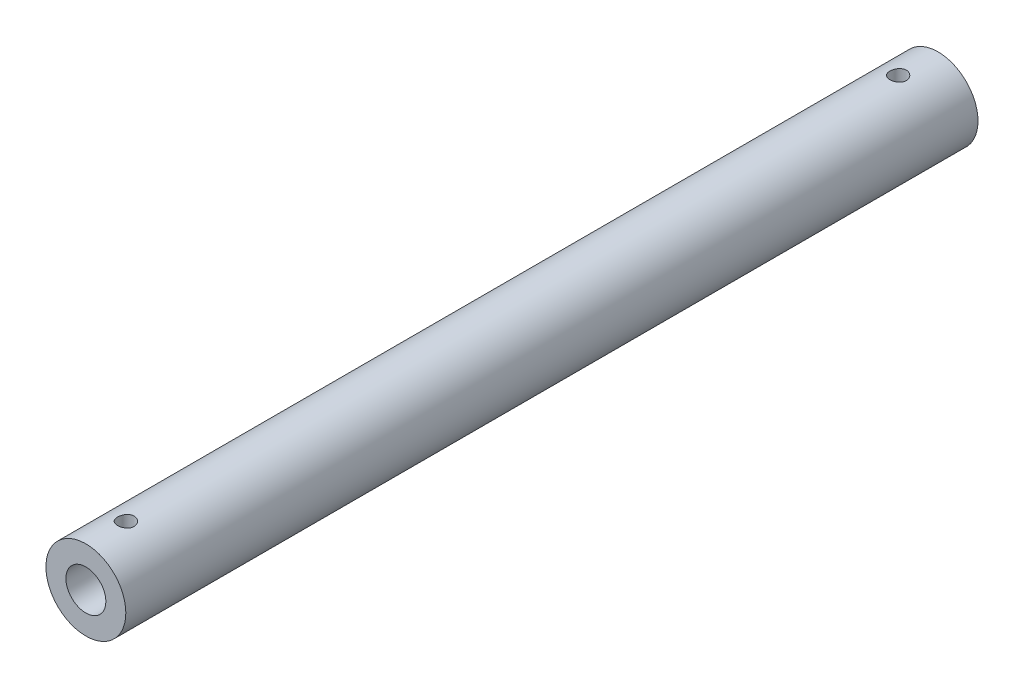
ISO-10303-21;
HEADER;
FILE_DESCRIPTION(('STEP AP214'),'2;1');
FILE_NAME('part.step','',(''),(''),'','','');
FILE_SCHEMA(('AUTOMOTIVE_DESIGN { 1 0 10303 214 1 1 1 1 }'));
ENDSEC;
DATA;
#1=APPLICATION_CONTEXT('core data for automotive mechanical design processes');
#2=APPLICATION_PROTOCOL_DEFINITION('international standard','automotive_design',2000,#1);
#3=PRODUCT_CONTEXT('',#1,'mechanical');
#4=PRODUCT('Part','Part','',(#3));
#5=PRODUCT_RELATED_PRODUCT_CATEGORY('part','',(#4));
#6=PRODUCT_DEFINITION_FORMATION('','',#4);
#7=PRODUCT_DEFINITION_CONTEXT('part definition',#1,'design');
#8=PRODUCT_DEFINITION('design','',#6,#7);
#9=PRODUCT_DEFINITION_SHAPE('','',#8);
#10=(LENGTH_UNIT() NAMED_UNIT(*) SI_UNIT(.MILLI.,.METRE.));
#11=(NAMED_UNIT(*) PLANE_ANGLE_UNIT() SI_UNIT($,.RADIAN.));
#12=(NAMED_UNIT(*) SI_UNIT($,.STERADIAN.) SOLID_ANGLE_UNIT());
#13=UNCERTAINTY_MEASURE_WITH_UNIT(LENGTH_MEASURE(1.E-05),#10,'distance_accuracy_value','');
#14=(GEOMETRIC_REPRESENTATION_CONTEXT(3) GLOBAL_UNCERTAINTY_ASSIGNED_CONTEXT((#13)) GLOBAL_UNIT_ASSIGNED_CONTEXT((#10,
#11,#12)) REPRESENTATION_CONTEXT('',''));
#15=CARTESIAN_POINT('',(0.,0.,0.));
#16=DIRECTION('',(0.,0.,1.));
#17=DIRECTION('',(1.,0.,0.));
#18=AXIS2_PLACEMENT_3D('',#15,#16,#17);
#19=CARTESIAN_POINT('',(0.,0.,-160.));
#20=DIRECTION('',(0.,0.,1.));
#21=DIRECTION('',(1.,0.,0.));
#22=AXIS2_PLACEMENT_3D('',#19,#20,#21);
#23=CYLINDRICAL_SURFACE('',#22,15.);
#24=CARTESIAN_POINT('',(0.,15.,-148.1));
#25=CARTESIAN_POINT('',(-0.172165692568075,14.9999968145247,-148.09999381543));
#26=CARTESIAN_POINT('',(-0.344408344623984,14.997005579049,-148.085609118986));
#27=CARTESIAN_POINT('',(-0.684016768751701,14.9853616038391,-148.028500942385));
#28=CARTESIAN_POINT('',(-0.851378698493533,14.9767045230125,-147.985755732451));
#29=CARTESIAN_POINT('',(-1.17626714760312,14.9546945810427,-147.873310094182));
#30=CARTESIAN_POINT('',(-1.33380320695701,14.9413463608244,-147.803636299415));
#31=CARTESIAN_POINT('',(-1.63494054093473,14.9114015957254,-147.639392320627));
#32=CARTESIAN_POINT('',(-1.77854248092075,14.8948052060611,-147.544823326167));
#33=CARTESIAN_POINT('',(-2.0498140026125,14.8599203077403,-147.332029294186));
#34=CARTESIAN_POINT('',(-2.17725387792712,14.841612714398,-147.21351452613));
#35=CARTESIAN_POINT('',(-2.41059374938866,14.8055061029318,-146.956815694495));
#36=CARTESIAN_POINT('',(-2.51649198363873,14.7877071265103,-146.818630023598));
#37=CARTESIAN_POINT('',(-2.70473262746812,14.7544460628154,-146.524843667008));
#38=CARTESIAN_POINT('',(-2.78683486689837,14.7390084976833,-146.369086071954));
#39=CARTESIAN_POINT('',(-2.92361365563604,14.7124902368737,-146.045614255889));
#40=CARTESIAN_POINT('',(-2.97829310959917,14.7014090797868,-145.877901303354));
#41=CARTESIAN_POINT('',(-3.05792378241659,14.6850518417562,-145.537758146124));
#42=CARTESIAN_POINT('',(-3.08327931876007,14.6796968878264,-145.365426467552));
#43=CARTESIAN_POINT('',(-3.1047987188951,14.6751611480918,-145.018878361106));
#44=CARTESIAN_POINT('',(-3.10096577486347,14.6759796871273,-144.844662141413));
#45=CARTESIAN_POINT('',(-3.06454338331475,14.6836268744082,-144.502264766051));
#46=CARTESIAN_POINT('',(-3.03241955530402,14.6903582036209,-144.334031580759));
#47=CARTESIAN_POINT('',(-2.941063176862,14.7089190681247,-144.005395009546));
#48=CARTESIAN_POINT('',(-2.88182925294599,14.7207488617187,-143.844992020783));
#49=CARTESIAN_POINT('',(-2.73749545783407,14.7482719850807,-143.535238650951));
#50=CARTESIAN_POINT('',(-2.65221295005861,14.7639924411575,-143.385975882204));
#51=CARTESIAN_POINT('',(-2.45833155039526,14.7975084496401,-143.103705768882));
#52=CARTESIAN_POINT('',(-2.34972980522964,14.8153042558583,-142.970700416647));
#53=CARTESIAN_POINT('',(-2.10980951412048,14.8513860400371,-142.722035981014));
#54=CARTESIAN_POINT('',(-1.97809406671113,14.8696748609556,-142.606759914395));
#55=CARTESIAN_POINT('',(-1.69699917981562,14.9043690302707,-142.399875525577));
#56=CARTESIAN_POINT('',(-1.54761948341343,14.920774351266,-142.30826754768));
#57=CARTESIAN_POINT('',(-1.23499644988397,14.949897695655,-142.151240719438));
#58=CARTESIAN_POINT('',(-1.0717293661543,14.9626092321176,-142.085867866775));
#59=CARTESIAN_POINT('',(-0.736208050305239,14.9828639201261,-141.983587276251));
#60=CARTESIAN_POINT('',(-0.563954985205535,14.9904077410196,-141.94667585185));
#61=CARTESIAN_POINT('',(-0.218640650723564,14.9993830838028,-141.902913286729));
#62=CARTESIAN_POINT('',(-0.0456484522188019,15.0009211054796,-141.895538320091));
#63=CARTESIAN_POINT('',(0.299096179156921,14.9980082795858,-141.909644148286));
#64=CARTESIAN_POINT('',(0.47084868604656,14.9935577925971,-141.931123205753));
#65=CARTESIAN_POINT('',(0.806532778422362,14.9792348501822,-142.001892432191));
#66=CARTESIAN_POINT('',(0.970523916752338,14.9694152228943,-142.050911753812));
#67=CARTESIAN_POINT('',(1.28795822388415,14.9454516233604,-142.175072449413));
#68=CARTESIAN_POINT('',(1.44140056223108,14.9313073111298,-142.250215877199));
#69=CARTESIAN_POINT('',(1.73557589191957,14.899998810058,-142.425610431486));
#70=CARTESIAN_POINT('',(1.87611842957523,14.8827978643853,-142.526174288314));
#71=CARTESIAN_POINT('',(2.13852141882691,14.8473663952166,-142.749138749663));
#72=CARTESIAN_POINT('',(2.26037971863336,14.8291357534649,-142.871541865818));
#73=CARTESIAN_POINT('',(2.48399401838078,14.7933375094228,-143.137101775973));
#74=CARTESIAN_POINT('',(2.58538928856013,14.7757855941988,-143.280564810953));
#75=CARTESIAN_POINT('',(2.76264557446454,14.7436744809272,-143.582793178194));
#76=CARTESIAN_POINT('',(2.83850764553234,14.729115159199,-143.741557877655));
#77=CARTESIAN_POINT('',(2.96206237859333,14.704766460738,-144.069061308399));
#78=CARTESIAN_POINT('',(3.00990595506134,14.6949515802098,-144.237741117651));
#79=CARTESIAN_POINT('',(3.07651834817521,14.681151621117,-144.580971786161));
#80=CARTESIAN_POINT('',(3.09529124863373,14.6771657237085,-144.755521817258));
#81=CARTESIAN_POINT('',(3.10307030783305,14.6755226409731,-145.101911198647));
#82=CARTESIAN_POINT('',(3.0926471129851,14.6777441283759,-145.273737409335));
#83=CARTESIAN_POINT('',(3.04359493211144,14.6879932817592,-145.613129865978));
#84=CARTESIAN_POINT('',(3.00496620761724,14.6960208939033,-145.780696151417));
#85=CARTESIAN_POINT('',(2.90086151532538,14.716921819634,-146.106417808972));
#86=CARTESIAN_POINT('',(2.83546006555444,14.7297816752769,-146.264597918068));
#87=CARTESIAN_POINT('',(2.67973384395483,14.7589049039727,-146.567827922407));
#88=CARTESIAN_POINT('',(2.58940680339969,14.7751685868093,-146.712876620833));
#89=CARTESIAN_POINT('',(2.38446392361929,14.809635154064,-146.988558165098));
#90=CARTESIAN_POINT('',(2.26943782754736,14.8278678241242,-147.118882357203));
#91=CARTESIAN_POINT('',(2.01920377162768,14.8640090653401,-147.35856705457));
#92=CARTESIAN_POINT('',(1.88399117387354,14.8819175609528,-147.46792272903));
#93=CARTESIAN_POINT('',(1.59538198786285,14.9156320795551,-147.663740386232));
#94=CARTESIAN_POINT('',(1.44179699181802,14.931412025711,-147.749929381312));
#95=CARTESIAN_POINT('',(1.1220352287178,14.9588332815734,-147.895136111828));
#96=CARTESIAN_POINT('',(0.955869690892333,14.9704782304995,-147.954177753271));
#97=CARTESIAN_POINT('',(0.657833295489258,14.9861185683186,-148.03229271379));
#98=CARTESIAN_POINT('',(0.527631279793755,14.9912930325766,-148.057636596675));
#99=CARTESIAN_POINT('',(0.264967984387546,14.9982349131395,-148.091492317775));
#100=CARTESIAN_POINT('',(0.132506785912508,15.0000024516911,-148.100004759935));
#101=CARTESIAN_POINT('',(0.,15.,-148.1));
#102=B_SPLINE_CURVE_WITH_KNOTS('',3,(#24,#25,#26,#27,#28,#29,#30,#31,#32,#33,#34,#35,#36,#37,
#38,#39,#40,#41,#42,#43,#44,#45,#46,#47,#48,#49,#50,#51,#52,#53,#54,#55,#56,#57,#58,#59,#60,#61,
#62,#63,#64,#65,#66,#67,#68,#69,#70,#71,#72,#73,#74,#75,#76,#77,#78,#79,#80,#81,#82,#83,#84,#85,
#86,#87,#88,#89,#90,#91,#92,#93,#94,#95,#96,#97,#98,#99,#100,#101),.UNSPECIFIED.,.T.,.F.,(4,2,2,
2,2,2,2,2,2,2,2,2,2,2,2,2,2,2,2,2,2,2,2,2,2,2,2,2,2,2,2,2,2,2,2,2,2,2,4),(0.,0.516012233354276,
1.03242029170924,1.54831890115687,2.06419286401489,2.58672901286761,3.10930788292939,
3.63699074660939,4.16461770564988,4.68487960325836,5.20508460362237,5.71688465009023,
6.22871062886656,6.74421096019478,7.25977440270464,7.78525818005796,8.31074960120177,
8.83715837566196,9.36349895418802,9.88046246952419,10.3973948586867,10.9093302438091,
11.4213058850333,11.9399157526589,12.4585853017375,12.9857239359749,13.5128407797481,
14.0370916901281,14.5612689477046,15.0752728884932,15.5892720633186,16.1018502189675,
16.6144750448609,17.1363837856733,17.6584126215689,18.1863470781733,18.7138157401919,
19.1109771901377,19.5081243889402),.UNSPECIFIED.);
#103=CARTESIAN_POINT('',(0.,15.,-148.1));
#104=VERTEX_POINT('',#103);
#105=EDGE_CURVE('E74',#104,#104,#102,.T.);
#106=ORIENTED_EDGE('',*,*,#105,.F.);
#107=EDGE_LOOP('',(#106));
#108=FACE_BOUND('',#107,.T.);
#109=CARTESIAN_POINT('',(0.,0.,-160.));
#110=DIRECTION('',(0.,0.,1.));
#111=DIRECTION('',(1.,0.,0.));
#112=AXIS2_PLACEMENT_3D('',#109,#110,#111);
#113=CIRCLE('',#112,15.);
#114=CARTESIAN_POINT('',(15.,0.,-160.));
#115=VERTEX_POINT('',#114);
#116=EDGE_CURVE('E10',#115,#115,#113,.T.);
#117=ORIENTED_EDGE('',*,*,#116,.T.);
#118=EDGE_LOOP('',(#117));
#119=FACE_BOUND('',#118,.T.);
#120=CARTESIAN_POINT('',(0.,0.,160.));
#121=DIRECTION('',(0.,0.,1.));
#122=DIRECTION('',(1.,0.,0.));
#123=AXIS2_PLACEMENT_3D('',#120,#121,#122);
#124=CIRCLE('',#123,15.);
#125=CARTESIAN_POINT('',(15.,0.,160.));
#126=VERTEX_POINT('',#125);
#127=EDGE_CURVE('E63',#126,#126,#124,.T.);
#128=ORIENTED_EDGE('',*,*,#127,.F.);
#129=EDGE_LOOP('',(#128));
#130=FACE_BOUND('',#129,.T.);
#131=CARTESIAN_POINT('',(0.,15.,141.9));
#132=CARTESIAN_POINT('',(0.172165692568075,14.9999968145247,141.90000618457));
#133=CARTESIAN_POINT('',(0.344408344623984,14.997005579049,141.914390881015));
#134=CARTESIAN_POINT('',(0.684016768751701,14.9853616038391,141.971499057615));
#135=CARTESIAN_POINT('',(0.851378698493532,14.9767045230125,142.014244267549));
#136=CARTESIAN_POINT('',(1.17626714760312,14.9546945810427,142.126689905818));
#137=CARTESIAN_POINT('',(1.33380320695702,14.9413463608244,142.196363700585));
#138=CARTESIAN_POINT('',(1.63494054093474,14.9114015957254,142.360607679373));
#139=CARTESIAN_POINT('',(1.77854248092075,14.8948052060611,142.455176673833));
#140=CARTESIAN_POINT('',(2.0498140026125,14.8599203077403,142.667970705814));
#141=CARTESIAN_POINT('',(2.17725387792712,14.841612714398,142.78648547387));
#142=CARTESIAN_POINT('',(2.41059374938866,14.8055061029318,143.043184305505));
#143=CARTESIAN_POINT('',(2.51649198363873,14.7877071265103,143.181369976402));
#144=CARTESIAN_POINT('',(2.70473262746812,14.7544460628154,143.475156332992));
#145=CARTESIAN_POINT('',(2.78683486689837,14.7390084976833,143.630913928046));
#146=CARTESIAN_POINT('',(2.92361365563604,14.7124902368737,143.954385744112));
#147=CARTESIAN_POINT('',(2.97829310959917,14.7014090797868,144.122098696646));
#148=CARTESIAN_POINT('',(3.05792378241659,14.6850518417562,144.462241853876));
#149=CARTESIAN_POINT('',(3.08327931876007,14.6796968878264,144.634573532448));
#150=CARTESIAN_POINT('',(3.1047987188951,14.6751611480918,144.981121638894));
#151=CARTESIAN_POINT('',(3.10096577486347,14.6759796871273,145.155337858587));
#152=CARTESIAN_POINT('',(3.06454338331475,14.6836268744082,145.497735233949));
#153=CARTESIAN_POINT('',(3.03241955530402,14.6903582036209,145.665968419241));
#154=CARTESIAN_POINT('',(2.941063176862,14.7089190681247,145.994604990454));
#155=CARTESIAN_POINT('',(2.88182925294599,14.7207488617187,146.155007979217));
#156=CARTESIAN_POINT('',(2.73749545783407,14.7482719850807,146.464761349049));
#157=CARTESIAN_POINT('',(2.65221295005861,14.7639924411575,146.614024117796));
#158=CARTESIAN_POINT('',(2.45833155039526,14.7975084496401,146.896294231118));
#159=CARTESIAN_POINT('',(2.34972980522964,14.8153042558583,147.029299583353));
#160=CARTESIAN_POINT('',(2.10980951412048,14.8513860400371,147.277964018986));
#161=CARTESIAN_POINT('',(1.97809406671112,14.8696748609556,147.393240085605));
#162=CARTESIAN_POINT('',(1.69699917981561,14.9043690302707,147.600124474423));
#163=CARTESIAN_POINT('',(1.54761948341342,14.920774351266,147.69173245232));
#164=CARTESIAN_POINT('',(1.23499644988397,14.949897695655,147.848759280562));
#165=CARTESIAN_POINT('',(1.0717293661543,14.9626092321176,147.914132133225));
#166=CARTESIAN_POINT('',(0.73620805030524,14.9828639201261,148.016412723749));
#167=CARTESIAN_POINT('',(0.563954985205536,14.9904077410196,148.05332414815));
#168=CARTESIAN_POINT('',(0.218640650723564,14.9993830838028,148.097086713271));
#169=CARTESIAN_POINT('',(0.0456484522188019,15.0009211054796,148.104461679909));
#170=CARTESIAN_POINT('',(-0.299096179156921,14.9980082795858,148.090355851714));
#171=CARTESIAN_POINT('',(-0.47084868604656,14.9935577925971,148.068876794247));
#172=CARTESIAN_POINT('',(-0.806532778422362,14.9792348501822,147.99810756781));
#173=CARTESIAN_POINT('',(-0.970523916752338,14.9694152228943,147.949088246188));
#174=CARTESIAN_POINT('',(-1.28795822388415,14.9454516233604,147.824927550587));
#175=CARTESIAN_POINT('',(-1.44140056223108,14.9313073111298,147.749784122801));
#176=CARTESIAN_POINT('',(-1.73557589191957,14.899998810058,147.574389568514));
#177=CARTESIAN_POINT('',(-1.87611842957523,14.8827978643853,147.473825711686));
#178=CARTESIAN_POINT('',(-2.13852141882691,14.8473663952166,147.250861250337));
#179=CARTESIAN_POINT('',(-2.26037971863336,14.8291357534649,147.128458134182));
#180=CARTESIAN_POINT('',(-2.48399401838078,14.7933375094228,146.862898224027));
#181=CARTESIAN_POINT('',(-2.58538928856013,14.7757855941988,146.719435189048));
#182=CARTESIAN_POINT('',(-2.76264557446454,14.7436744809272,146.417206821806));
#183=CARTESIAN_POINT('',(-2.83850764553234,14.729115159199,146.258442122345));
#184=CARTESIAN_POINT('',(-2.96206237859333,14.704766460738,145.930938691601));
#185=CARTESIAN_POINT('',(-3.00990595506134,14.6949515802098,145.76225888235));
#186=CARTESIAN_POINT('',(-3.07651834817521,14.681151621117,145.419028213839));
#187=CARTESIAN_POINT('',(-3.09529124863373,14.6771657237085,145.244478182742));
#188=CARTESIAN_POINT('',(-3.10307030783305,14.6755226409731,144.898088801353));
#189=CARTESIAN_POINT('',(-3.0926471129851,14.6777441283759,144.726262590665));
#190=CARTESIAN_POINT('',(-3.04359493211144,14.6879932817592,144.386870134022));
#191=CARTESIAN_POINT('',(-3.00496620761724,14.6960208939033,144.219303848583));
#192=CARTESIAN_POINT('',(-2.90086151532538,14.716921819634,143.893582191028));
#193=CARTESIAN_POINT('',(-2.83546006555444,14.7297816752769,143.735402081932));
#194=CARTESIAN_POINT('',(-2.67973384395483,14.7589049039727,143.432172077593));
#195=CARTESIAN_POINT('',(-2.58940680339969,14.7751685868093,143.287123379167));
#196=CARTESIAN_POINT('',(-2.3844639236193,14.809635154064,143.011441834902));
#197=CARTESIAN_POINT('',(-2.26943782754737,14.8278678241242,142.881117642797));
#198=CARTESIAN_POINT('',(-2.0192037716277,14.8640090653401,142.64143294543));
#199=CARTESIAN_POINT('',(-1.88399117387354,14.8819175609528,142.53207727097));
#200=CARTESIAN_POINT('',(-1.59538198786284,14.9156320795551,142.336259613768));
#201=CARTESIAN_POINT('',(-1.44179699181802,14.931412025711,142.250070618688));
#202=CARTESIAN_POINT('',(-1.1220352287178,14.9588332815734,142.104863888172));
#203=CARTESIAN_POINT('',(-0.955869690892333,14.9704782304995,142.045822246729));
#204=CARTESIAN_POINT('',(-0.657833295489258,14.9861185683186,141.96770728621));
#205=CARTESIAN_POINT('',(-0.527631279793755,14.9912930325766,141.942363403325));
#206=CARTESIAN_POINT('',(-0.264967984387546,14.9982349131395,141.908507682225));
#207=CARTESIAN_POINT('',(-0.132506785912508,15.0000024516911,141.899995240065));
#208=CARTESIAN_POINT('',(0.,15.,141.9));
#209=B_SPLINE_CURVE_WITH_KNOTS('',3,(#131,#132,#133,#134,#135,#136,#137,#138,#139,#140,#141,
#142,#143,#144,#145,#146,#147,#148,#149,#150,#151,#152,#153,#154,#155,#156,#157,#158,#159,#160,
#161,#162,#163,#164,#165,#166,#167,#168,#169,#170,#171,#172,#173,#174,#175,#176,#177,#178,#179,
#180,#181,#182,#183,#184,#185,#186,#187,#188,#189,#190,#191,#192,#193,#194,#195,#196,#197,#198,
#199,#200,#201,#202,#203,#204,#205,#206,#207,#208),.UNSPECIFIED.,.T.,.F.,(4,2,2,2,2,2,2,2,2,2,2,
2,2,2,2,2,2,2,2,2,2,2,2,2,2,2,2,2,2,2,2,2,2,2,2,2,2,2,4),(0.,0.516012233354276,1.03242029170924,
1.54831890115688,2.06419286401489,2.58672901286762,3.10930788292939,3.6369907466094,
4.16461770564988,4.68487960325836,5.20508460362237,5.71688465009023,6.22871062886656,
6.74421096019478,7.25977440270464,7.78525818005799,8.31074960120178,8.83715837566196,
9.36349895418802,9.8804624695242,10.3973948586867,10.9093302438091,11.4213058850333,
11.9399157526589,12.4585853017375,12.9857239359749,13.5128407797481,14.0370916901281,
14.5612689477046,15.0752728884932,15.5892720633186,16.1018502189675,16.6144750448609,
17.1363837856733,17.6584126215689,18.1863470781733,18.7138157401919,19.1109771901377,
19.5081243889402),.UNSPECIFIED.);
#210=CARTESIAN_POINT('',(0.,15.,141.9));
#211=VERTEX_POINT('',#210);
#212=EDGE_CURVE('E73',#211,#211,#209,.T.);
#213=ORIENTED_EDGE('',*,*,#212,.T.);
#214=EDGE_LOOP('',(#213));
#215=FACE_BOUND('',#214,.T.);
#216=ADVANCED_FACE('F43',(#108,#119,#130,#215),#23,.T.);
#217=CARTESIAN_POINT('',(0.,0.,-160.));
#218=DIRECTION('',(0.,0.,1.));
#219=DIRECTION('',(1.,0.,0.));
#220=AXIS2_PLACEMENT_3D('',#217,#218,#219);
#221=CYLINDRICAL_SURFACE('',#220,7.5);
#222=CARTESIAN_POINT('',(0.,7.5,-148.1));
#223=CARTESIAN_POINT('',(-0.166153002613096,7.49999499657015,-148.099993560861));
#224=CARTESIAN_POINT('',(-0.332600464403827,7.49441556709234,-148.086562897393));
#225=CARTESIAN_POINT('',(-0.660768761003523,7.47265556326767,-148.033340543021));
#226=CARTESIAN_POINT('',(-0.822475981409232,7.4564470859861,-147.99347946502));
#227=CARTESIAN_POINT('',(-1.13589928883872,7.41516232897275,-147.889102169766));
#228=CARTESIAN_POINT('',(-1.28764700409263,7.39011591076245,-147.824668918174));
#229=CARTESIAN_POINT('',(-1.57803340286612,7.33360222650622,-147.67331942222));
#230=CARTESIAN_POINT('',(-1.71667615552021,7.30213696318032,-147.586410188248));
#231=CARTESIAN_POINT('',(-1.98400959910197,7.23419554679821,-147.38802235374));
#232=CARTESIAN_POINT('',(-2.11196525773686,7.19755699911941,-147.275609331583));
#233=CARTESIAN_POINT('',(-2.34783768718456,7.12411042208018,-147.031380070779));
#234=CARTESIAN_POINT('',(-2.45574406182104,7.0873023148786,-146.899553828929));
#235=CARTESIAN_POINT('',(-2.65359473144151,7.01570032840252,-146.612528599049));
#236=CARTESIAN_POINT('',(-2.74242148647985,6.98108925988135,-146.456508904596));
#237=CARTESIAN_POINT('',(-2.89224243961144,6.9203697427042,-146.130103258034));
#238=CARTESIAN_POINT('',(-2.95325074974891,6.89425698486144,-145.959724642166));
#239=CARTESIAN_POINT('',(-3.04268024888774,6.8552453498953,-145.617895908735));
#240=CARTESIAN_POINT('',(-3.07251470951095,6.84177651513845,-145.446883060868));
#241=CARTESIAN_POINT('',(-3.10316007729674,6.82793602371857,-145.101788941462));
#242=CARTESIAN_POINT('',(-3.1039866281101,6.82755730769831,-144.927709374454));
#243=CARTESIAN_POINT('',(-3.07765851268915,6.83945669009682,-144.595396882851));
#244=CARTESIAN_POINT('',(-3.05260360053316,6.85078502883839,-144.436956806988));
#245=CARTESIAN_POINT('',(-2.97874158057689,6.88321931438638,-144.126771871286));
#246=CARTESIAN_POINT('',(-2.92993000846889,6.90432709889237,-143.975028275686));
#247=CARTESIAN_POINT('',(-2.80899254802325,6.95441629953129,-143.67874504467));
#248=CARTESIAN_POINT('',(-2.73639615555452,6.98355455159122,-143.534425164898));
#249=CARTESIAN_POINT('',(-2.57028194875633,7.04638370508448,-143.259460751997));
#250=CARTESIAN_POINT('',(-2.47675595937095,7.0800763834253,-143.128821591876));
#251=CARTESIAN_POINT('',(-2.26231791362188,7.15162260147758,-142.87350982613));
#252=CARTESIAN_POINT('',(-2.13977666022389,7.18958932893573,-142.750233476726));
#253=CARTESIAN_POINT('',(-1.87537753928264,7.26304146095989,-142.52551666153));
#254=CARTESIAN_POINT('',(-1.73351530071415,7.29852630128623,-142.424081150276));
#255=CARTESIAN_POINT('',(-1.43031567972322,7.3640172601883,-142.243922241841));
#256=CARTESIAN_POINT('',(-1.26861343015351,7.3938829557076,-142.165758086691));
#257=CARTESIAN_POINT('',(-0.932805541489834,7.44369617955768,-142.038229960448));
#258=CARTESIAN_POINT('',(-0.758706702716555,7.46364909848067,-141.988850333718));
#259=CARTESIAN_POINT('',(-0.414723271042775,7.49038660533013,-141.923195297538));
#260=CARTESIAN_POINT('',(-0.245254188339055,7.49791555875999,-141.905045565378));
#261=CARTESIAN_POINT('',(0.0944609767199169,7.50132646954416,-141.896788462455));
#262=CARTESIAN_POINT('',(0.264706827033564,7.4972117034244,-141.906673202833));
#263=CARTESIAN_POINT('',(0.592423142194305,7.4782813005357,-141.952854999911));
#264=CARTESIAN_POINT('',(0.750112133817266,7.46399615818736,-141.987843312039));
#265=CARTESIAN_POINT('',(1.05721523253206,7.42672470407196,-142.081425890346));
#266=CARTESIAN_POINT('',(1.20662828750661,7.40373728888471,-142.140023150123));
#267=CARTESIAN_POINT('',(1.49816127489848,7.35038535240201,-142.281075671479));
#268=CARTESIAN_POINT('',(1.63991168325742,7.31981428517995,-142.364214037498));
#269=CARTESIAN_POINT('',(1.90795528937434,7.25456871961594,-142.551236821863));
#270=CARTESIAN_POINT('',(2.03424204531875,7.21989252291917,-142.655129839031));
#271=CARTESIAN_POINT('',(2.27711097618432,7.14716389966532,-142.88927079263));
#272=CARTESIAN_POINT('',(2.39238480652959,7.10904560593693,-143.020858882595));
#273=CARTESIAN_POINT('',(2.59957048468988,7.03593167919986,-143.302133859859));
#274=CARTESIAN_POINT('',(2.69147733770028,7.00093671485367,-143.451824606615));
#275=CARTESIAN_POINT('',(2.85022442048548,6.93784170380673,-143.767969197309));
#276=CARTESIAN_POINT('',(2.91671570889455,6.90983935005117,-143.934619185321));
#277=CARTESIAN_POINT('',(3.02013779062217,6.86527482101638,-144.278268446669));
#278=CARTESIAN_POINT('',(3.05709243461339,6.84870341679441,-144.455259245664));
#279=CARTESIAN_POINT('',(3.09804010789086,6.83027124265743,-144.800073573326));
#280=CARTESIAN_POINT('',(3.10432447712996,6.82738831148697,-144.967571705527));
#281=CARTESIAN_POINT('',(3.08985007296316,6.8339513608338,-145.301131935177));
#282=CARTESIAN_POINT('',(3.06909529490486,6.84339551988094,-145.467194241136));
#283=CARTESIAN_POINT('',(3.00304618929307,6.87262082828987,-145.785463431884));
#284=CARTESIAN_POINT('',(2.95890039997521,6.89191674393384,-145.937957441214));
#285=CARTESIAN_POINT('',(2.84843476313013,6.93829866651057,-146.233415007748));
#286=CARTESIAN_POINT('',(2.78210870560486,6.96538685481484,-146.376375882421));
#287=CARTESIAN_POINT('',(2.62461324834435,7.0263027906572,-146.658001407506));
#288=CARTESIAN_POINT('',(2.53219913435249,7.06043592217453,-146.795902621572));
#289=CARTESIAN_POINT('',(2.32690149913443,7.13072826622725,-147.05495975473));
#290=CARTESIAN_POINT('',(2.21401106371445,7.16688816027646,-147.176109993131));
#291=CARTESIAN_POINT('',(1.96144980129082,7.24024921308954,-147.407083847818));
#292=CARTESIAN_POINT('',(1.82044465095395,7.27734125674949,-147.515487243136));
#293=CARTESIAN_POINT('',(1.52076323380497,7.34580237908538,-147.707187341193));
#294=CARTESIAN_POINT('',(1.3620789361027,7.37716883966076,-147.790472569605));
#295=CARTESIAN_POINT('',(1.11564028430047,7.41701967357549,-147.893638057475));
#296=CARTESIAN_POINT('',(1.03279444562307,7.42903456588251,-147.924237418566));
#297=CARTESIAN_POINT('',(0.864502653411435,7.45049041775362,-147.978326747309));
#298=CARTESIAN_POINT('',(0.779057950570136,7.45993259430366,-148.001820076947));
#299=CARTESIAN_POINT('',(0.606439030534145,7.4759436159557,-148.04139083623));
#300=CARTESIAN_POINT('',(0.519269667431427,7.48251958049345,-148.057486646192));
#301=CARTESIAN_POINT('',(0.343742028836127,7.49263353478285,-148.082155918649));
#302=CARTESIAN_POINT('',(0.255384680685462,7.49617376860472,-148.090734937803));
#303=CARTESIAN_POINT('',(0.13904715035892,7.49876251103851,-148.097005054432));
#304=CARTESIAN_POINT('',(0.111252100871385,7.4992261831606,-148.098127675765));
#305=CARTESIAN_POINT('',(0.0556407868836748,7.4998453469052,-148.099625688481));
#306=CARTESIAN_POINT('',(0.027824522339763,7.50000083789064,-148.100001078319));
#307=CARTESIAN_POINT('',(0.,7.5,-148.1));
#308=B_SPLINE_CURVE_WITH_KNOTS('',3,(#222,#223,#224,#225,#226,#227,#228,#229,#230,#231,#232,
#233,#234,#235,#236,#237,#238,#239,#240,#241,#242,#243,#244,#245,#246,#247,#248,#249,#250,#251,
#252,#253,#254,#255,#256,#257,#258,#259,#260,#261,#262,#263,#264,#265,#266,#267,#268,#269,#270,
#271,#272,#273,#274,#275,#276,#277,#278,#279,#280,#281,#282,#283,#284,#285,#286,#287,#288,#289,
#290,#291,#292,#293,#294,#295,#296,#297,#298,#299,#300,#301,#302,#303,#304,#305,#306,#307),
.UNSPECIFIED.,.T.,.F.,(4,2,2,2,2,2,2,2,2,2,2,2,2,2,2,2,2,2,2,2,2,2,2,2,2,2,2,2,2,2,2,2,2,2,2,2,
2,2,2,2,2,2,4),(0.,0.498350072093011,0.998013657585997,1.49600490175053,1.99384100650709,
2.51422237468695,3.03487282828193,3.58063836896801,4.12612673889393,4.64564263404288,
5.16487835560281,5.64506306376063,6.12533804220394,6.61575367999806,7.10636120848081,
7.63770794739145,8.16917509423633,8.71253919590832,9.25560749053009,9.76477034291972,
10.2737899318645,10.758038466616,11.2423484231004,11.7416676385667,12.2411941567273,
12.7758736132641,13.310667264219,13.8525600209147,14.3940147589522,14.8943247334461,
15.394560789723,15.8722439818827,16.3500610271901,16.8563461469573,17.3628025422318,
17.9053115722873,18.448068053912,18.7151630289678,18.9821314383947,19.2484328877127,
19.5145373117832,19.5979924635495,19.6814477878343),.UNSPECIFIED.);
#309=CARTESIAN_POINT('',(0.,7.5,-148.1));
#310=VERTEX_POINT('',#309);
#311=EDGE_CURVE('E47',#310,#310,#308,.T.);
#312=ORIENTED_EDGE('',*,*,#311,.T.);
#313=EDGE_LOOP('',(#312));
#314=FACE_BOUND('',#313,.T.);
#315=CARTESIAN_POINT('',(0.,0.,-160.));
#316=DIRECTION('',(0.,0.,1.));
#317=DIRECTION('',(1.,0.,0.));
#318=AXIS2_PLACEMENT_3D('',#315,#316,#317);
#319=CIRCLE('',#318,7.5);
#320=CARTESIAN_POINT('',(7.5,0.,-160.));
#321=VERTEX_POINT('',#320);
#322=EDGE_CURVE('E57',#321,#321,#319,.T.);
#323=ORIENTED_EDGE('',*,*,#322,.F.);
#324=EDGE_LOOP('',(#323));
#325=FACE_BOUND('',#324,.T.);
#326=CARTESIAN_POINT('',(0.,0.,160.));
#327=DIRECTION('',(0.,0.,1.));
#328=DIRECTION('',(1.,0.,0.));
#329=AXIS2_PLACEMENT_3D('',#326,#327,#328);
#330=CIRCLE('',#329,7.5);
#331=CARTESIAN_POINT('',(7.5,0.,160.));
#332=VERTEX_POINT('',#331);
#333=EDGE_CURVE('E94',#332,#332,#330,.T.);
#334=ORIENTED_EDGE('',*,*,#333,.T.);
#335=EDGE_LOOP('',(#334));
#336=FACE_BOUND('',#335,.T.);
#337=CARTESIAN_POINT('',(0.,7.5,141.9));
#338=CARTESIAN_POINT('',(0.166153002613096,7.49999499657015,141.900006439139));
#339=CARTESIAN_POINT('',(0.332600464403827,7.49441556709234,141.913437102607));
#340=CARTESIAN_POINT('',(0.660768761003523,7.47265556326767,141.966659456979));
#341=CARTESIAN_POINT('',(0.822475981409232,7.4564470859861,142.00652053498));
#342=CARTESIAN_POINT('',(1.13589928883872,7.41516232897275,142.110897830234));
#343=CARTESIAN_POINT('',(1.28764700409263,7.39011591076245,142.175331081826));
#344=CARTESIAN_POINT('',(1.57803340286612,7.33360222650622,142.32668057778));
#345=CARTESIAN_POINT('',(1.71667615552021,7.30213696318032,142.413589811752));
#346=CARTESIAN_POINT('',(1.98400959910197,7.23419554679821,142.61197764626));
#347=CARTESIAN_POINT('',(2.11196525773686,7.19755699911941,142.724390668417));
#348=CARTESIAN_POINT('',(2.34783768718456,7.12411042208018,142.968619929221));
#349=CARTESIAN_POINT('',(2.45574406182104,7.0873023148786,143.100446171071));
#350=CARTESIAN_POINT('',(2.65359473144151,7.01570032840252,143.387471400951));
#351=CARTESIAN_POINT('',(2.74242148647985,6.98108925988135,143.543491095404));
#352=CARTESIAN_POINT('',(2.89224243961144,6.9203697427042,143.869896741966));
#353=CARTESIAN_POINT('',(2.95325074974891,6.89425698486144,144.040275357834));
#354=CARTESIAN_POINT('',(3.04268024888774,6.8552453498953,144.382104091265));
#355=CARTESIAN_POINT('',(3.07251470951095,6.84177651513845,144.553116939132));
#356=CARTESIAN_POINT('',(3.10316007729674,6.82793602371857,144.898211058538));
#357=CARTESIAN_POINT('',(3.1039866281101,6.82755730769831,145.072290625546));
#358=CARTESIAN_POINT('',(3.07765851268915,6.83945669009682,145.404603117149));
#359=CARTESIAN_POINT('',(3.05260360053316,6.85078502883839,145.563043193012));
#360=CARTESIAN_POINT('',(2.97874158057689,6.88321931438638,145.873228128714));
#361=CARTESIAN_POINT('',(2.92993000846889,6.90432709889237,146.024971724314));
#362=CARTESIAN_POINT('',(2.80899254802325,6.95441629953129,146.32125495533));
#363=CARTESIAN_POINT('',(2.73639615555452,6.98355455159122,146.465574835102));
#364=CARTESIAN_POINT('',(2.57028194875633,7.04638370508448,146.740539248003));
#365=CARTESIAN_POINT('',(2.47675595937095,7.0800763834253,146.871178408124));
#366=CARTESIAN_POINT('',(2.26231791362188,7.15162260147758,147.12649017387));
#367=CARTESIAN_POINT('',(2.13977666022389,7.18958932893573,147.249766523274));
#368=CARTESIAN_POINT('',(1.87537753928264,7.26304146095989,147.47448333847));
#369=CARTESIAN_POINT('',(1.73351530071415,7.29852630128623,147.575918849724));
#370=CARTESIAN_POINT('',(1.43031567972322,7.3640172601883,147.756077758159));
#371=CARTESIAN_POINT('',(1.26861343015351,7.3938829557076,147.834241913309));
#372=CARTESIAN_POINT('',(0.932805541489834,7.44369617955768,147.961770039552));
#373=CARTESIAN_POINT('',(0.758706702716555,7.46364909848067,148.011149666282));
#374=CARTESIAN_POINT('',(0.414723271042775,7.49038660533013,148.076804702462));
#375=CARTESIAN_POINT('',(0.245254188339055,7.49791555875999,148.094954434622));
#376=CARTESIAN_POINT('',(-0.0944609767199173,7.50132646954416,148.103211537545));
#377=CARTESIAN_POINT('',(-0.264706827033564,7.4972117034244,148.093326797167));
#378=CARTESIAN_POINT('',(-0.592423142194305,7.4782813005357,148.047145000089));
#379=CARTESIAN_POINT('',(-0.750112133817266,7.46399615818736,148.012156687961));
#380=CARTESIAN_POINT('',(-1.05721523253206,7.42672470407196,147.918574109654));
#381=CARTESIAN_POINT('',(-1.20662828750661,7.40373728888471,147.859976849877));
#382=CARTESIAN_POINT('',(-1.49816127489848,7.35038535240201,147.718924328521));
#383=CARTESIAN_POINT('',(-1.63991168325742,7.31981428517995,147.635785962502));
#384=CARTESIAN_POINT('',(-1.90795528937434,7.25456871961594,147.448763178137));
#385=CARTESIAN_POINT('',(-2.03424204531875,7.21989252291917,147.344870160969));
#386=CARTESIAN_POINT('',(-2.27711097618432,7.14716389966532,147.11072920737));
#387=CARTESIAN_POINT('',(-2.39238480652959,7.10904560593693,146.979141117405));
#388=CARTESIAN_POINT('',(-2.59957048468988,7.03593167919986,146.697866140141));
#389=CARTESIAN_POINT('',(-2.69147733770028,7.00093671485367,146.548175393385));
#390=CARTESIAN_POINT('',(-2.85022442048548,6.93784170380673,146.232030802691));
#391=CARTESIAN_POINT('',(-2.91671570889455,6.90983935005117,146.065380814679));
#392=CARTESIAN_POINT('',(-3.02013779062217,6.86527482101638,145.721731553331));
#393=CARTESIAN_POINT('',(-3.05709243461339,6.84870341679441,145.544740754336));
#394=CARTESIAN_POINT('',(-3.09804010789086,6.83027124265743,145.199926426674));
#395=CARTESIAN_POINT('',(-3.10432447712996,6.82738831148697,145.032428294473));
#396=CARTESIAN_POINT('',(-3.08985007296316,6.8339513608338,144.698868064823));
#397=CARTESIAN_POINT('',(-3.06909529490486,6.84339551988094,144.532805758864));
#398=CARTESIAN_POINT('',(-3.00304618929307,6.87262082828987,144.214536568116));
#399=CARTESIAN_POINT('',(-2.95890039997521,6.89191674393384,144.062042558786));
#400=CARTESIAN_POINT('',(-2.84843476313013,6.93829866651057,143.766584992252));
#401=CARTESIAN_POINT('',(-2.78210870560486,6.96538685481484,143.623624117579));
#402=CARTESIAN_POINT('',(-2.62461324834435,7.0263027906572,143.341998592494));
#403=CARTESIAN_POINT('',(-2.53219913435249,7.06043592217452,143.204097378428));
#404=CARTESIAN_POINT('',(-2.32690149913444,7.13072826622725,142.94504024527));
#405=CARTESIAN_POINT('',(-2.21401106371446,7.16688816027646,142.823890006869));
#406=CARTESIAN_POINT('',(-1.96144980129082,7.24024921308954,142.592916152182));
#407=CARTESIAN_POINT('',(-1.82044465095395,7.27734125674949,142.484512756864));
#408=CARTESIAN_POINT('',(-1.52076323380497,7.34580237908538,142.292812658807));
#409=CARTESIAN_POINT('',(-1.3620789361027,7.37716883966076,142.209527430395));
#410=CARTESIAN_POINT('',(-1.11564028430047,7.41701967357549,142.106361942525));
#411=CARTESIAN_POINT('',(-1.03279444562307,7.42903456588251,142.075762581434));
#412=CARTESIAN_POINT('',(-0.864502653411435,7.45049041775362,142.021673252691));
#413=CARTESIAN_POINT('',(-0.779057950570136,7.45993259430366,141.998179923053));
#414=CARTESIAN_POINT('',(-0.606439030534145,7.4759436159557,141.95860916377));
#415=CARTESIAN_POINT('',(-0.519269667431427,7.48251958049345,141.942513353808));
#416=CARTESIAN_POINT('',(-0.343742028836127,7.49263353478285,141.917844081351));
#417=CARTESIAN_POINT('',(-0.255384680685462,7.49617376860472,141.909265062197));
#418=CARTESIAN_POINT('',(-0.139047150358921,7.49876251103851,141.902994945568));
#419=CARTESIAN_POINT('',(-0.111252100871386,7.4992261831606,141.901872324235));
#420=CARTESIAN_POINT('',(-0.0556407868836758,7.4998453469052,141.900374311519));
#421=CARTESIAN_POINT('',(-0.0278245223397635,7.50000083789064,141.899998921681));
#422=CARTESIAN_POINT('',(0.,7.5,141.9));
#423=B_SPLINE_CURVE_WITH_KNOTS('',3,(#337,#338,#339,#340,#341,#342,#343,#344,#345,#346,#347,
#348,#349,#350,#351,#352,#353,#354,#355,#356,#357,#358,#359,#360,#361,#362,#363,#364,#365,#366,
#367,#368,#369,#370,#371,#372,#373,#374,#375,#376,#377,#378,#379,#380,#381,#382,#383,#384,#385,
#386,#387,#388,#389,#390,#391,#392,#393,#394,#395,#396,#397,#398,#399,#400,#401,#402,#403,#404,
#405,#406,#407,#408,#409,#410,#411,#412,#413,#414,#415,#416,#417,#418,#419,#420,#421,#422),
.UNSPECIFIED.,.T.,.F.,(4,2,2,2,2,2,2,2,2,2,2,2,2,2,2,2,2,2,2,2,2,2,2,2,2,2,2,2,2,2,2,2,2,2,2,2,
2,2,2,2,2,2,4),(0.,0.498350072093011,0.998013657585997,1.49600490175053,1.99384100650709,
2.51422237468695,3.03487282828193,3.58063836896801,4.12612673889393,4.64564263404288,
5.16487835560281,5.64506306376063,6.12533804220394,6.61575367999806,7.10636120848081,
7.63770794739145,8.16917509423633,8.71253919590832,9.25560749053009,9.76477034291972,
10.2737899318645,10.758038466616,11.2423484231004,11.7416676385667,12.2411941567273,
12.7758736132641,13.310667264219,13.8525600209147,14.3940147589522,14.8943247334461,
15.394560789723,15.8722439818827,16.3500610271901,16.8563461469572,17.3628025422318,
17.9053115722873,18.448068053912,18.7151630289678,18.9821314383947,19.2484328877127,
19.5145373117832,19.5979924635495,19.6814477878343),.UNSPECIFIED.);
#424=CARTESIAN_POINT('',(0.,7.5,141.9));
#425=VERTEX_POINT('',#424);
#426=EDGE_CURVE('E66',#425,#425,#423,.T.);
#427=ORIENTED_EDGE('',*,*,#426,.F.);
#428=EDGE_LOOP('',(#427));
#429=FACE_BOUND('',#428,.T.);
#430=ADVANCED_FACE('F75',(#314,#325,#336,#429),#221,.F.);
#431=CARTESIAN_POINT('',(0.,0.,-160.));
#432=DIRECTION('',(0.,0.,1.));
#433=DIRECTION('',(1.,0.,0.));
#434=AXIS2_PLACEMENT_3D('',#431,#432,#433);
#435=PLANE('',#434);
#436=ORIENTED_EDGE('',*,*,#322,.T.);
#437=EDGE_LOOP('',(#436));
#438=FACE_BOUND('',#437,.T.);
#439=ORIENTED_EDGE('',*,*,#116,.F.);
#440=EDGE_LOOP('',(#439));
#441=FACE_BOUND('',#440,.T.);
#442=ADVANCED_FACE('F114',(#438,#441),#435,.F.);
#443=CARTESIAN_POINT('',(0.,0.,160.));
#444=DIRECTION('',(0.,0.,1.));
#445=DIRECTION('',(1.,0.,0.));
#446=AXIS2_PLACEMENT_3D('',#443,#444,#445);
#447=PLANE('',#446);
#448=ORIENTED_EDGE('',*,*,#127,.T.);
#449=EDGE_LOOP('',(#448));
#450=FACE_BOUND('',#449,.T.);
#451=ORIENTED_EDGE('',*,*,#333,.F.);
#452=EDGE_LOOP('',(#451));
#453=FACE_BOUND('',#452,.T.);
#454=ADVANCED_FACE('F82',(#450,#453),#447,.T.);
#455=CARTESIAN_POINT('',(0.,15.,145.));
#456=DIRECTION('',(0.,-1.,0.));
#457=DIRECTION('',(0.,0.,-1.));
#458=AXIS2_PLACEMENT_3D('',#455,#456,#457);
#459=CYLINDRICAL_SURFACE('',#458,3.1);
#460=ORIENTED_EDGE('',*,*,#212,.F.);
#461=EDGE_LOOP('',(#460));
#462=FACE_BOUND('',#461,.T.);
#463=ORIENTED_EDGE('',*,*,#426,.T.);
#464=EDGE_LOOP('',(#463));
#465=FACE_BOUND('',#464,.T.);
#466=ADVANCED_FACE('F78',(#462,#465),#459,.F.);
#467=CARTESIAN_POINT('',(0.,15.,-145.));
#468=DIRECTION('',(0.,-1.,0.));
#469=DIRECTION('',(0.,0.,-1.));
#470=AXIS2_PLACEMENT_3D('',#467,#468,#469);
#471=CYLINDRICAL_SURFACE('',#470,3.1);
#472=ORIENTED_EDGE('',*,*,#105,.T.);
#473=EDGE_LOOP('',(#472));
#474=FACE_BOUND('',#473,.T.);
#475=ORIENTED_EDGE('',*,*,#311,.F.);
#476=EDGE_LOOP('',(#475));
#477=FACE_BOUND('',#476,.T.);
#478=ADVANCED_FACE('F81',(#474,#477),#471,.F.);
#479=CLOSED_SHELL('',(#216,#430,#442,#454,#466,#478));
#480=MANIFOLD_SOLID_BREP('B2',#479);
#481=ADVANCED_BREP_SHAPE_REPRESENTATION('',(#18,#480),#14);
#482=SHAPE_DEFINITION_REPRESENTATION(#9,#481);
ENDSEC;
END-ISO-10303-21;
